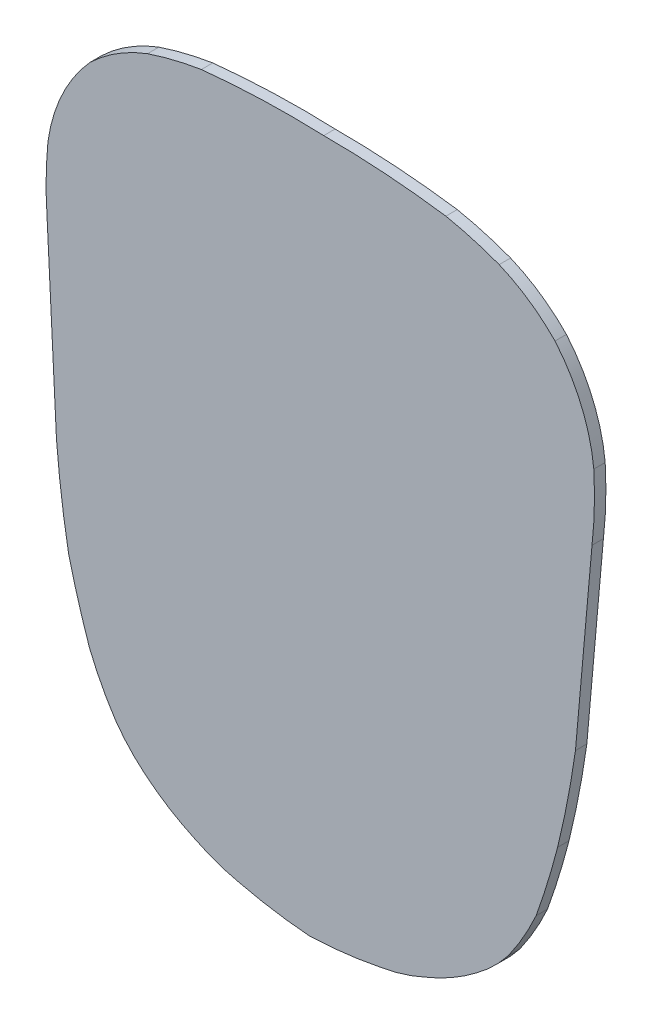
ISO-10303-21;
HEADER;
FILE_DESCRIPTION(('STEP AP214'),'2;1');
FILE_NAME('part.step','',(''),(''),'','','');
FILE_SCHEMA(('AUTOMOTIVE_DESIGN { 1 0 10303 214 1 1 1 1 }'));
ENDSEC;
DATA;
#1=APPLICATION_CONTEXT('core data for automotive mechanical design processes');
#2=APPLICATION_PROTOCOL_DEFINITION('international standard','automotive_design',2000,#1);
#3=PRODUCT_CONTEXT('',#1,'mechanical');
#4=PRODUCT('Part','Part','',(#3));
#5=PRODUCT_RELATED_PRODUCT_CATEGORY('part','',(#4));
#6=PRODUCT_DEFINITION_FORMATION('','',#4);
#7=PRODUCT_DEFINITION_CONTEXT('part definition',#1,'design');
#8=PRODUCT_DEFINITION('design','',#6,#7);
#9=PRODUCT_DEFINITION_SHAPE('','',#8);
#10=(LENGTH_UNIT() NAMED_UNIT(*) SI_UNIT(.MILLI.,.METRE.));
#11=(NAMED_UNIT(*) PLANE_ANGLE_UNIT() SI_UNIT($,.RADIAN.));
#12=(NAMED_UNIT(*) SI_UNIT($,.STERADIAN.) SOLID_ANGLE_UNIT());
#13=UNCERTAINTY_MEASURE_WITH_UNIT(LENGTH_MEASURE(1.E-05),#10,'distance_accuracy_value','');
#14=(GEOMETRIC_REPRESENTATION_CONTEXT(3) GLOBAL_UNCERTAINTY_ASSIGNED_CONTEXT((#13)) GLOBAL_UNIT_ASSIGNED_CONTEXT((#10,
#11,#12)) REPRESENTATION_CONTEXT('',''));
#15=CARTESIAN_POINT('',(0.,0.,0.));
#16=DIRECTION('',(0.,0.,1.));
#17=DIRECTION('',(1.,0.,0.));
#18=AXIS2_PLACEMENT_3D('',#15,#16,#17);
#19=CARTESIAN_POINT('',(-2.87645068487016,-22.2307778413905,37.7490965279302));
#20=DIRECTION('',(0.,0.,1.));
#21=DIRECTION('',(0.0193548335692301,0.999812677663925,0.));
#22=AXIS2_PLACEMENT_3D('',#19,#20,#21);
#23=PLANE('',#22);
#24=CARTESIAN_POINT('',(3.40605421210544,8.02001484887181,37.74909652793));
#25=DIRECTION('',(0.,0.,-1.));
#26=DIRECTION('',(-0.0193548335692301,-0.999812677663925,0.));
#27=AXIS2_PLACEMENT_3D('',#24,#25,#26);
#28=CIRCLE('',#27,7.43643173112);
#29=CARTESIAN_POINT('',(8.74976189327244,13.1916011731871,37.74909652793));
#30=VERTEX_POINT('',#29);
#31=CARTESIAN_POINT('',(6.29473617833669,14.8724621043842,37.74909652793));
#32=VERTEX_POINT('',#31);
#33=EDGE_CURVE('E362',#30,#32,#28,.F.);
#34=ORIENTED_EDGE('',*,*,#33,.F.);
#35=CARTESIAN_POINT('',(3.11803650286193,8.43130453548566,37.7490965279299));
#36=DIRECTION('',(0.,0.,-1.));
#37=DIRECTION('',(-0.0193548335692301,-0.999812677663925,0.));
#38=AXIS2_PLACEMENT_3D('',#35,#36,#37);
#39=CIRCLE('',#38,7.3740595978);
#40=CARTESIAN_POINT('',(10.4553019723894,9.16702892789532,37.7490965279302));
#41=VERTEX_POINT('',#40);
#42=EDGE_CURVE('E208',#41,#30,#39,.F.);
#43=ORIENTED_EDGE('',*,*,#42,.F.);
#44=CARTESIAN_POINT('',(-6.32552371849095,8.14421174061835,37.7490965279296));
#45=DIRECTION('',(0.,0.,-1.));
#46=DIRECTION('',(-0.0193548335692301,-0.999812677663925,0.));
#47=AXIS2_PLACEMENT_3D('',#44,#45,#46);
#48=CIRCLE('',#47,16.81196793556);
#49=CARTESIAN_POINT('',(10.3766044314373,6.2255713027891,37.7490965279302));
#50=VERTEX_POINT('',#49);
#51=EDGE_CURVE('E35',#50,#41,#48,.F.);
#52=ORIENTED_EDGE('',*,*,#51,.F.);
#53=DIRECTION('',(-0.0886995040357044,-0.996058431008854,0.));
#54=VECTOR('',#53,1.);
#55=CARTESIAN_POINT('',(10.3766044314373,6.22557130278913,37.7490965279302));
#56=LINE('',#55,#54);
#57=CARTESIAN_POINT('',(9.64811099468481,-1.95510611475094,37.7490965279302));
#58=VERTEX_POINT('',#57);
#59=EDGE_CURVE('E207',#50,#58,#56,.T.);
#60=ORIENTED_EDGE('',*,*,#59,.T.);
#61=CARTESIAN_POINT('',(-31.2814474166911,3.80134354731966,37.7490965279289));
#62=DIRECTION('',(0.,0.,-1.));
#63=DIRECTION('',(-0.0193548335692301,-0.999812677663925,0.));
#64=AXIS2_PLACEMENT_3D('',#61,#62,#63);
#65=CIRCLE('',#64,41.33237791928);
#66=CARTESIAN_POINT('',(8.86403234955447,-6.03257321052169,37.7490965279303));
#67=VERTEX_POINT('',#66);
#68=EDGE_CURVE('E218',#67,#58,#65,.F.);
#69=ORIENTED_EDGE('',*,*,#68,.F.);
#70=CARTESIAN_POINT('',(-24.973760623793,2.68335405814088,37.7490965279291));
#71=DIRECTION('',(0.,0.,-1.));
#72=DIRECTION('',(-0.0193548335692301,-0.999812677663925,0.));
#73=AXIS2_PLACEMENT_3D('',#70,#71,#72);
#74=CIRCLE('',#73,34.94228987144);
#75=CARTESIAN_POINT('',(7.91947678147986,-9.10641075970419,37.7490965279303));
#76=VERTEX_POINT('',#75);
#77=EDGE_CURVE('E302',#76,#67,#74,.F.);
#78=ORIENTED_EDGE('',*,*,#77,.F.);
#79=CARTESIAN_POINT('',(-3.58067037627299,-3.93497982202906,37.7490965279299));
#80=DIRECTION('',(0.,0.,-1.));
#81=DIRECTION('',(-0.0193548335692301,-0.999812677663925,0.));
#82=AXIS2_PLACEMENT_3D('',#79,#80,#81);
#83=CIRCLE('',#82,12.60940452968);
#84=CARTESIAN_POINT('',(6.6977668305515,-11.2391437836663,37.7490965279303));
#85=VERTEX_POINT('',#84);
#86=EDGE_CURVE('E305',#85,#76,#83,.F.);
#87=ORIENTED_EDGE('',*,*,#86,.F.);
#88=CARTESIAN_POINT('',(1.10266886694143,-6.8693447401081,37.74909652793));
#89=DIRECTION('',(0.,0.,-1.));
#90=DIRECTION('',(-0.0193548335692301,-0.999812677663925,0.));
#91=AXIS2_PLACEMENT_3D('',#88,#89,#90);
#92=CIRCLE('',#91,7.09931439672);
#93=CARTESIAN_POINT('',(5.30083998115867,-12.5943446701717,37.7490965279303));
#94=VERTEX_POINT('',#93);
#95=EDGE_CURVE('E308',#94,#85,#92,.F.);
#96=ORIENTED_EDGE('',*,*,#95,.F.);
#97=CARTESIAN_POINT('',(-0.638723059391806,-4.8395373063229,37.74909652793));
#98=DIRECTION('',(0.,0.,-1.));
#99=DIRECTION('',(-0.0193548335692301,-0.999812677663925,0.));
#100=AXIS2_PLACEMENT_3D('',#97,#98,#99);
#101=CIRCLE('',#100,9.76808304444);
#102=CARTESIAN_POINT('',(3.02325465351682,-13.8952187049387,37.7490965279302));
#103=VERTEX_POINT('',#102);
#104=EDGE_CURVE('E311',#103,#94,#101,.F.);
#105=ORIENTED_EDGE('',*,*,#104,.F.);
#106=CARTESIAN_POINT('',(-0.207770559998101,-6.83732878190939,37.74909652793));
#107=DIRECTION('',(0.,0.,-1.));
#108=DIRECTION('',(-0.0193548335692301,-0.999812677663925,0.));
#109=AXIS2_PLACEMENT_3D('',#106,#107,#108);
#110=CIRCLE('',#109,7.76230211316);
#111=CARTESIAN_POINT('',(1.1176538211111,-14.4856347581325,37.7490965279302));
#112=VERTEX_POINT('',#111);
#113=EDGE_CURVE('E314',#112,#103,#110,.F.);
#114=ORIENTED_EDGE('',*,*,#113,.F.);
#115=CARTESIAN_POINT('',(-2.80966912930586,4.75500909683406,37.7490965279298));
#116=DIRECTION('',(0.,0.,-1.));
#117=DIRECTION('',(-0.0193548335692301,-0.999812677663925,0.));
#118=AXIS2_PLACEMENT_3D('',#115,#116,#117);
#119=CIRCLE('',#118,19.6373684976);
#120=CARTESIAN_POINT('',(-2.01526832310904,-14.8662846645275,37.7490965279301));
#121=VERTEX_POINT('',#120);
#122=EDGE_CURVE('E317',#121,#112,#119,.F.);
#123=ORIENTED_EDGE('',*,*,#122,.F.);
#124=CARTESIAN_POINT('',(-0.523207579480535,4.71400533480674,37.7490965279299));
#125=DIRECTION('',(0.,0.,-1.));
#126=DIRECTION('',(-0.0193548335692301,-0.999812677663925,0.));
#127=AXIS2_PLACEMENT_3D('',#124,#125,#126);
#128=CIRCLE('',#127,19.63705684976);
#129=CARTESIAN_POINT('',(-5.17633782189552,-14.3637927736708,37.74909652793));
#130=VERTEX_POINT('',#129);
#131=EDGE_CURVE('E320',#130,#121,#128,.F.);
#132=ORIENTED_EDGE('',*,*,#131,.F.);
#133=CARTESIAN_POINT('',(-3.55589855490548,-6.77251418057695,37.7490965279299));
#134=DIRECTION('',(0.,0.,-1.));
#135=DIRECTION('',(-0.0193548335692301,-0.999812677663925,0.));
#136=AXIS2_PLACEMENT_3D('',#133,#134,#135);
#137=CIRCLE('',#136,7.76230211316);
#138=CARTESIAN_POINT('',(-7.05766041396077,-13.7000677154429,37.7490965279299));
#139=VERTEX_POINT('',#138);
#140=EDGE_CURVE('E323',#139,#130,#137,.F.);
#141=ORIENTED_EDGE('',*,*,#140,.F.);
#142=CARTESIAN_POINT('',(-3.04794957670766,-4.7928983915392,37.7490965279299));
#143=DIRECTION('',(0.,0.,-1.));
#144=DIRECTION('',(-0.0193548335692301,-0.999812677663925,0.));
#145=AXIS2_PLACEMENT_3D('',#142,#143,#144);
#146=CIRCLE('',#145,9.76808304444);
#147=CARTESIAN_POINT('',(-9.28319236302824,-12.3120202657153,37.7490965279298));
#148=VERTEX_POINT('',#147);
#149=EDGE_CURVE('E326',#148,#139,#146,.F.);
#150=ORIENTED_EDGE('',*,*,#149,.F.);
#151=CARTESIAN_POINT('',(-4.76167465689586,-6.83879977530864,37.7490965279299));
#152=DIRECTION('',(0.,0.,-1.));
#153=DIRECTION('',(-0.0193548335692301,-0.999812677663925,0.));
#154=AXIS2_PLACEMENT_3D('',#151,#152,#153);
#155=CIRCLE('',#154,7.09931439672);
#156=CARTESIAN_POINT('',(-10.5813963887554,-10.9046457963968,37.7490965279298));
#157=VERTEX_POINT('',#156);
#158=EDGE_CURVE('E329',#157,#148,#155,.F.);
#159=ORIENTED_EDGE('',*,*,#158,.F.);
#160=CARTESIAN_POINT('',(-0.0279711922388365,-4.00375460651088,37.74909652793));
#161=DIRECTION('',(0.,0.,-1.));
#162=DIRECTION('',(-0.0193548335692301,-0.999812677663925,0.));
#163=AXIS2_PLACEMENT_3D('',#160,#161,#162);
#164=CIRCLE('',#163,12.60940452968);
#165=CARTESIAN_POINT('',(-11.7196490905639,-8.72622753019508,37.7490965279297));
#166=VERTEX_POINT('',#165);
#167=EDGE_CURVE('E332',#166,#157,#164,.F.);
#168=ORIENTED_EDGE('',*,*,#167,.F.);
#169=CARTESIAN_POINT('',(21.3074102324667,2.68328490166428,37.7490965279306));
#170=DIRECTION('',(0.,0.,-1.));
#171=DIRECTION('',(-0.0193548335692301,-0.999812677663925,0.));
#172=AXIS2_PLACEMENT_3D('',#169,#170,#171);
#173=CIRCLE('',#172,34.94228987144);
#174=CARTESIAN_POINT('',(-12.6348799299236,-5.61638738053116,37.7490965279296));
#175=VERTEX_POINT('',#174);
#176=EDGE_CURVE('E335',#175,#166,#173,.F.);
#177=ORIENTED_EDGE('',*,*,#176,.F.);
#178=CARTESIAN_POINT('',(28.0310735031444,1.77588533100571,37.7490965279308));
#179=DIRECTION('',(0.,0.,-1.));
#180=DIRECTION('',(-0.0193548335692301,-0.999812677663925,0.));
#181=AXIS2_PLACEMENT_3D('',#178,#179,#180);
#182=CIRCLE('',#181,41.33237791928);
#183=CARTESIAN_POINT('',(-13.1702154109103,-1.51337845938621,37.7490965279296));
#184=VERTEX_POINT('',#183);
#185=EDGE_CURVE('E338',#184,#175,#182,.F.);
#186=ORIENTED_EDGE('',*,*,#185,.F.);
#187=DIRECTION('',(-0.0500831809567765,0.998745050042928,0.));
#188=VECTOR('',#187,1.);
#189=CARTESIAN_POINT('',(-13.1702154109103,-1.51337845938582,37.7490965279296));
#190=LINE('',#189,#188);
#191=CARTESIAN_POINT('',(-13.5815510662259,6.68936429385876,37.7490965279294));
#192=VERTEX_POINT('',#191);
#193=EDGE_CURVE('E226',#184,#192,#190,.T.);
#194=ORIENTED_EDGE('',*,*,#193,.T.);
#195=CARTESIAN_POINT('',(3.18231954948581,7.96015453853926,37.74909652793));
#196=DIRECTION('',(0.,0.,-1.));
#197=DIRECTION('',(-0.0193548335692301,-0.999812677663925,0.));
#198=AXIS2_PLACEMENT_3D('',#195,#196,#197);
#199=CIRCLE('',#198,16.81196793556);
#200=CARTESIAN_POINT('',(-13.5463481289565,9.63166390750369,37.7490965279294));
#201=VERTEX_POINT('',#200);
#202=EDGE_CURVE('E229',#201,#192,#199,.F.);
#203=ORIENTED_EDGE('',*,*,#202,.F.);
#204=CARTESIAN_POINT('',(-6.24305419079941,8.61252083374827,37.7490965279296));
#205=DIRECTION('',(0.,0.,-1.));
#206=DIRECTION('',(-0.0193548335692301,-0.999812677663925,0.));
#207=AXIS2_PLACEMENT_3D('',#204,#205,#206);
#208=CIRCLE('',#207,7.3740595978);
#209=CARTESIAN_POINT('',(-11.6863252040826,13.5872123445715,37.7490965279294));
#210=VERTEX_POINT('',#209);
#211=EDGE_CURVE('E344',#210,#201,#208,.F.);
#212=ORIENTED_EDGE('',*,*,#211,.F.);
#213=CARTESIAN_POINT('',(-6.54677401618388,8.21268627443502,37.7490965279296));
#214=DIRECTION('',(0.,0.,-1.));
#215=DIRECTION('',(-0.0193548335692301,-0.999812677663925,0.));
#216=AXIS2_PLACEMENT_3D('',#213,#214,#215);
#217=CIRCLE('',#216,7.43643173112);
#218=CARTESIAN_POINT('',(-9.16808546254458,15.17179851615,37.7490965279295));
#219=VERTEX_POINT('',#218);
#220=EDGE_CURVE('E347',#219,#210,#217,.F.);
#221=ORIENTED_EDGE('',*,*,#220,.F.);
#222=CARTESIAN_POINT('',(-4.43670572158507,1.02428534892829,37.7490965279298));
#223=DIRECTION('',(0.,0.,-1.));
#224=DIRECTION('',(-0.0193548335692301,-0.999812677663925,0.));
#225=AXIS2_PLACEMENT_3D('',#222,#223,#224);
#226=CIRCLE('',#225,14.91771038296);
#227=CARTESIAN_POINT('',(-6.80003650135269,15.7536013783736,37.7490965279295));
#228=VERTEX_POINT('',#227);
#229=EDGE_CURVE('E350',#228,#219,#226,.F.);
#230=ORIENTED_EDGE('',*,*,#229,.F.);
#231=CARTESIAN_POINT('',(-2.87645068487016,-22.2307778413905,37.7490965279302));
#232=DIRECTION('',(0.,0.,-1.));
#233=DIRECTION('',(-0.0193548335692301,-0.999812677663925,0.));
#234=AXIS2_PLACEMENT_3D('',#231,#232,#233);
#235=CIRCLE('',#234,38.18648439396);
#236=CARTESIAN_POINT('',(-1.41914055333809,15.9278887698878,37.7490965279297));
#237=VERTEX_POINT('',#236);
#238=EDGE_CURVE('E353',#237,#228,#235,.F.);
#239=ORIENTED_EDGE('',*,*,#238,.F.);
#240=CARTESIAN_POINT('',(-1.43975485684205,-22.2585901013477,37.7490965279302));
#241=DIRECTION('',(0.,0.,-1.));
#242=DIRECTION('',(-0.0193548335692301,-0.999812677663925,0.));
#243=AXIS2_PLACEMENT_3D('',#240,#241,#242);
#244=CIRCLE('',#243,38.186484435371);
#245=CARTESIAN_POINT('',(3.95097858118662,15.5454782846467,37.7490965279299));
#246=VERTEX_POINT('',#245);
#247=EDGE_CURVE('E356',#246,#237,#244,.F.);
#248=ORIENTED_EDGE('',*,*,#247,.F.);
#249=CARTESIAN_POINT('',(1.01935833845516,0.918664351931265,37.74909652793));
#250=DIRECTION('',(0.,0.,-1.));
#251=DIRECTION('',(-0.0193548335692301,-0.999812677663925,0.));
#252=AXIS2_PLACEMENT_3D('',#249,#250,#251);
#253=CIRCLE('',#252,14.91771038296);
#254=EDGE_CURVE('E359',#32,#246,#253,.F.);
#255=ORIENTED_EDGE('',*,*,#254,.F.);
#256=EDGE_LOOP('',(#34,#43,#52,#60,#69,#78,#87,#96,#105,#114,#123,#132,#141,#150,#159,#168,#177,
#186,#194,#203,#212,#221,#230,#239,#248,#255));
#257=FACE_BOUND('',#256,.T.);
#258=ADVANCED_FACE('F32',(#257),#23,.F.);
#259=CARTESIAN_POINT('',(-6.32552371849096,8.14421174061835,38.1300965279296));
#260=DIRECTION('',(0.,0.,-1.));
#261=DIRECTION('',(-0.0193548335692301,-0.999812677663925,0.));
#262=AXIS2_PLACEMENT_3D('',#259,#260,#261);
#263=CYLINDRICAL_SURFACE('',#262,16.81196793556);
#264=DIRECTION('',(0.,0.,-1.));
#265=VECTOR('',#264,1.);
#266=CARTESIAN_POINT('',(10.4553019723893,9.16702892789537,38.1300965279302));
#267=LINE('',#266,#265);
#268=CARTESIAN_POINT('',(10.4553019723893,9.16702892789536,38.2500965279301));
#269=VERTEX_POINT('',#268);
#270=EDGE_CURVE('E211',#269,#41,#267,.T.);
#271=ORIENTED_EDGE('',*,*,#270,.F.);
#272=CARTESIAN_POINT('',(-6.32552371849096,8.14421174061835,38.2500965279296));
#273=DIRECTION('',(0.,0.,-1.));
#274=DIRECTION('',(-0.0193548335692301,-0.999812677663925,0.));
#275=AXIS2_PLACEMENT_3D('',#272,#273,#274);
#276=CIRCLE('',#275,16.81196793556);
#277=CARTESIAN_POINT('',(10.3766044314372,6.22557130278923,38.2500965279302));
#278=VERTEX_POINT('',#277);
#279=EDGE_CURVE('E216',#278,#269,#276,.F.);
#280=ORIENTED_EDGE('',*,*,#279,.F.);
#281=DIRECTION('',(0.,0.,1.));
#282=VECTOR('',#281,1.);
#283=CARTESIAN_POINT('',(10.3766044314372,6.22557130278915,38.1300965279302));
#284=LINE('',#283,#282);
#285=EDGE_CURVE('E213',#278,#50,#284,.F.);
#286=ORIENTED_EDGE('',*,*,#285,.T.);
#287=ORIENTED_EDGE('',*,*,#51,.T.);
#288=EDGE_LOOP('',(#271,#280,#286,#287));
#289=FACE_BOUND('',#288,.T.);
#290=ADVANCED_FACE('F214',(#289),#263,.T.);
#291=CARTESIAN_POINT('',(3.11803650286192,8.43130453548566,38.1300965279299));
#292=DIRECTION('',(0.,0.,-1.));
#293=DIRECTION('',(-0.0193548335692301,-0.999812677663925,0.));
#294=AXIS2_PLACEMENT_3D('',#291,#292,#293);
#295=CYLINDRICAL_SURFACE('',#294,7.3740595978);
#296=DIRECTION('',(0.,0.,-1.));
#297=VECTOR('',#296,1.);
#298=CARTESIAN_POINT('',(8.74976189327242,13.1916011731871,38.13009652793));
#299=LINE('',#298,#297);
#300=CARTESIAN_POINT('',(8.74976189327242,13.1916011731871,38.25009652793));
#301=VERTEX_POINT('',#300);
#302=EDGE_CURVE('E363',#301,#30,#299,.T.);
#303=ORIENTED_EDGE('',*,*,#302,.F.);
#304=CARTESIAN_POINT('',(3.11803650286191,8.43130453548566,38.2500965279299));
#305=DIRECTION('',(0.,0.,-1.));
#306=DIRECTION('',(-0.0193548335692301,-0.999812677663925,0.));
#307=AXIS2_PLACEMENT_3D('',#304,#305,#306);
#308=CIRCLE('',#307,7.3740595978);
#309=EDGE_CURVE('E296',#269,#301,#308,.F.);
#310=ORIENTED_EDGE('',*,*,#309,.F.);
#311=ORIENTED_EDGE('',*,*,#270,.T.);
#312=ORIENTED_EDGE('',*,*,#42,.T.);
#313=EDGE_LOOP('',(#303,#310,#311,#312));
#314=FACE_BOUND('',#313,.T.);
#315=ADVANCED_FACE('F367',(#314),#295,.T.);
#316=CARTESIAN_POINT('',(3.40605421210543,8.02001484887182,38.13009652793));
#317=DIRECTION('',(0.,0.,-1.));
#318=DIRECTION('',(-0.0193548335692301,-0.999812677663925,0.));
#319=AXIS2_PLACEMENT_3D('',#316,#317,#318);
#320=CYLINDRICAL_SURFACE('',#319,7.43643173112);
#321=DIRECTION('',(0.,0.,-1.));
#322=VECTOR('',#321,1.);
#323=CARTESIAN_POINT('',(6.29473617833669,14.8724621043842,38.13009652793));
#324=LINE('',#323,#322);
#325=CARTESIAN_POINT('',(6.29473617833668,14.8724621043842,38.2500965279299));
#326=VERTEX_POINT('',#325);
#327=EDGE_CURVE('E361',#326,#32,#324,.T.);
#328=ORIENTED_EDGE('',*,*,#327,.F.);
#329=CARTESIAN_POINT('',(3.40605421210542,8.02001484887182,38.2500965279299));
#330=DIRECTION('',(0.,0.,-1.));
#331=DIRECTION('',(-0.0193548335692301,-0.999812677663925,0.));
#332=AXIS2_PLACEMENT_3D('',#329,#330,#331);
#333=CIRCLE('',#332,7.43643173112);
#334=EDGE_CURVE('E293',#301,#326,#333,.F.);
#335=ORIENTED_EDGE('',*,*,#334,.F.);
#336=ORIENTED_EDGE('',*,*,#302,.T.);
#337=ORIENTED_EDGE('',*,*,#33,.T.);
#338=EDGE_LOOP('',(#328,#335,#336,#337));
#339=FACE_BOUND('',#338,.T.);
#340=ADVANCED_FACE('F423',(#339),#320,.T.);
#341=CARTESIAN_POINT('',(1.01935833845515,0.918664351931272,38.13009652793));
#342=DIRECTION('',(0.,0.,-1.));
#343=DIRECTION('',(-0.0193548335692301,-0.999812677663925,0.));
#344=AXIS2_PLACEMENT_3D('',#341,#342,#343);
#345=CYLINDRICAL_SURFACE('',#344,14.91771038296);
#346=DIRECTION('',(0.,0.,-1.));
#347=VECTOR('',#346,1.);
#348=CARTESIAN_POINT('',(3.95097858118664,15.5454782846467,38.1300965279299));
#349=LINE('',#348,#347);
#350=CARTESIAN_POINT('',(3.95097858118661,15.5454782846467,38.2500965279298));
#351=VERTEX_POINT('',#350);
#352=EDGE_CURVE('E358',#351,#246,#349,.T.);
#353=ORIENTED_EDGE('',*,*,#352,.F.);
#354=CARTESIAN_POINT('',(1.01935833845515,0.918664351931274,38.2500965279299));
#355=DIRECTION('',(0.,0.,-1.));
#356=DIRECTION('',(-0.0193548335692301,-0.999812677663925,0.));
#357=AXIS2_PLACEMENT_3D('',#354,#355,#356);
#358=CIRCLE('',#357,14.91771038296);
#359=EDGE_CURVE('E290',#326,#351,#358,.F.);
#360=ORIENTED_EDGE('',*,*,#359,.F.);
#361=ORIENTED_EDGE('',*,*,#327,.T.);
#362=ORIENTED_EDGE('',*,*,#254,.T.);
#363=EDGE_LOOP('',(#353,#360,#361,#362));
#364=FACE_BOUND('',#363,.T.);
#365=ADVANCED_FACE('F419',(#364),#345,.T.);
#366=CARTESIAN_POINT('',(-1.43975485684206,-22.2585901013477,38.1300965279302));
#367=DIRECTION('',(0.,0.,-1.));
#368=DIRECTION('',(-0.0193548335692301,-0.999812677663925,0.));
#369=AXIS2_PLACEMENT_3D('',#366,#367,#368);
#370=CYLINDRICAL_SURFACE('',#369,38.186484435371);
#371=DIRECTION('',(0.,0.,-1.));
#372=VECTOR('',#371,1.);
#373=CARTESIAN_POINT('',(-1.41914055333799,15.9278887698878,38.1300965279297));
#374=LINE('',#373,#372);
#375=CARTESIAN_POINT('',(-1.4191405533381,15.9278887698878,38.2500965279296));
#376=VERTEX_POINT('',#375);
#377=EDGE_CURVE('E355',#376,#237,#374,.T.);
#378=ORIENTED_EDGE('',*,*,#377,.F.);
#379=CARTESIAN_POINT('',(-1.43975485684206,-22.2585901013477,38.2500965279302));
#380=DIRECTION('',(0.,0.,-1.));
#381=DIRECTION('',(-0.0193548335692301,-0.999812677663925,0.));
#382=AXIS2_PLACEMENT_3D('',#379,#380,#381);
#383=CIRCLE('',#382,38.186484435371);
#384=EDGE_CURVE('E287',#351,#376,#383,.F.);
#385=ORIENTED_EDGE('',*,*,#384,.F.);
#386=ORIENTED_EDGE('',*,*,#352,.T.);
#387=ORIENTED_EDGE('',*,*,#247,.T.);
#388=EDGE_LOOP('',(#378,#385,#386,#387));
#389=FACE_BOUND('',#388,.T.);
#390=ADVANCED_FACE('F428',(#389),#370,.T.);
#391=CARTESIAN_POINT('',(-2.87645068487017,-22.2307778413905,38.1300965279302));
#392=DIRECTION('',(0.,0.,-1.));
#393=DIRECTION('',(-0.0193548335692301,-0.999812677663925,0.));
#394=AXIS2_PLACEMENT_3D('',#391,#392,#393);
#395=CYLINDRICAL_SURFACE('',#394,38.18648439396);
#396=DIRECTION('',(0.,0.,-1.));
#397=VECTOR('',#396,1.);
#398=CARTESIAN_POINT('',(-6.80003650135271,15.7536013783736,38.1300965279295));
#399=LINE('',#398,#397);
#400=CARTESIAN_POINT('',(-6.80003650135273,15.7536013783736,38.2500965279295));
#401=VERTEX_POINT('',#400);
#402=EDGE_CURVE('E352',#401,#228,#399,.T.);
#403=ORIENTED_EDGE('',*,*,#402,.F.);
#404=CARTESIAN_POINT('',(-2.87645068487018,-22.2307778413905,38.2500965279301));
#405=DIRECTION('',(0.,0.,-1.));
#406=DIRECTION('',(-0.0193548335692301,-0.999812677663925,0.));
#407=AXIS2_PLACEMENT_3D('',#404,#405,#406);
#408=CIRCLE('',#407,38.18648439396);
#409=EDGE_CURVE('E284',#376,#401,#408,.F.);
#410=ORIENTED_EDGE('',*,*,#409,.F.);
#411=ORIENTED_EDGE('',*,*,#377,.T.);
#412=ORIENTED_EDGE('',*,*,#238,.T.);
#413=EDGE_LOOP('',(#403,#410,#411,#412));
#414=FACE_BOUND('',#413,.T.);
#415=ADVANCED_FACE('F432',(#414),#395,.T.);
#416=CARTESIAN_POINT('',(-4.43670572158509,1.0242853489283,38.1300965279298));
#417=DIRECTION('',(0.,0.,-1.));
#418=DIRECTION('',(-0.0193548335692301,-0.999812677663925,0.));
#419=AXIS2_PLACEMENT_3D('',#416,#417,#418);
#420=CYLINDRICAL_SURFACE('',#419,14.91771038296);
#421=DIRECTION('',(0.,0.,-1.));
#422=VECTOR('',#421,1.);
#423=CARTESIAN_POINT('',(-9.16808546254456,15.17179851615,38.1300965279295));
#424=LINE('',#423,#422);
#425=CARTESIAN_POINT('',(-9.16808546254458,15.17179851615,38.2500965279295));
#426=VERTEX_POINT('',#425);
#427=EDGE_CURVE('E349',#426,#219,#424,.T.);
#428=ORIENTED_EDGE('',*,*,#427,.F.);
#429=CARTESIAN_POINT('',(-4.43670572158509,1.0242853489283,38.2500965279298));
#430=DIRECTION('',(0.,0.,-1.));
#431=DIRECTION('',(-0.0193548335692301,-0.999812677663925,0.));
#432=AXIS2_PLACEMENT_3D('',#429,#430,#431);
#433=CIRCLE('',#432,14.91771038296);
#434=EDGE_CURVE('E281',#401,#426,#433,.F.);
#435=ORIENTED_EDGE('',*,*,#434,.F.);
#436=ORIENTED_EDGE('',*,*,#402,.T.);
#437=ORIENTED_EDGE('',*,*,#229,.T.);
#438=EDGE_LOOP('',(#428,#435,#436,#437));
#439=FACE_BOUND('',#438,.T.);
#440=ADVANCED_FACE('F434',(#439),#420,.T.);
#441=CARTESIAN_POINT('',(-6.5467740161839,8.21268627443503,38.1300965279296));
#442=DIRECTION('',(0.,0.,-1.));
#443=DIRECTION('',(-0.0193548335692301,-0.999812677663925,0.));
#444=AXIS2_PLACEMENT_3D('',#441,#442,#443);
#445=CYLINDRICAL_SURFACE('',#444,7.43643173112);
#446=DIRECTION('',(0.,0.,-1.));
#447=VECTOR('',#446,1.);
#448=CARTESIAN_POINT('',(-11.6863252040826,13.5872123445715,38.1300965279294));
#449=LINE('',#448,#447);
#450=CARTESIAN_POINT('',(-11.6863252040826,13.5872123445715,38.2500965279294));
#451=VERTEX_POINT('',#450);
#452=EDGE_CURVE('E346',#451,#210,#449,.T.);
#453=ORIENTED_EDGE('',*,*,#452,.F.);
#454=CARTESIAN_POINT('',(-6.5467740161839,8.21268627443503,38.2500965279296));
#455=DIRECTION('',(0.,0.,-1.));
#456=DIRECTION('',(-0.0193548335692301,-0.999812677663925,0.));
#457=AXIS2_PLACEMENT_3D('',#454,#455,#456);
#458=CIRCLE('',#457,7.43643173112);
#459=EDGE_CURVE('E278',#426,#451,#458,.F.);
#460=ORIENTED_EDGE('',*,*,#459,.F.);
#461=ORIENTED_EDGE('',*,*,#427,.T.);
#462=ORIENTED_EDGE('',*,*,#220,.T.);
#463=EDGE_LOOP('',(#453,#460,#461,#462));
#464=FACE_BOUND('',#463,.T.);
#465=ADVANCED_FACE('F438',(#464),#445,.T.);
#466=CARTESIAN_POINT('',(-6.24305419079942,8.61252083374827,38.1300965279296));
#467=DIRECTION('',(0.,0.,-1.));
#468=DIRECTION('',(-0.0193548335692301,-0.999812677663925,0.));
#469=AXIS2_PLACEMENT_3D('',#466,#467,#468);
#470=CYLINDRICAL_SURFACE('',#469,7.3740595978);
#471=DIRECTION('',(0.,0.,-1.));
#472=VECTOR('',#471,1.);
#473=CARTESIAN_POINT('',(-13.5463481289565,9.6316639075037,38.1300965279294));
#474=LINE('',#473,#472);
#475=CARTESIAN_POINT('',(-13.5463481289566,9.63166390750369,38.2500965279294));
#476=VERTEX_POINT('',#475);
#477=EDGE_CURVE('E343',#476,#201,#474,.T.);
#478=ORIENTED_EDGE('',*,*,#477,.F.);
#479=CARTESIAN_POINT('',(-6.24305419079943,8.61252083374827,38.2500965279296));
#480=DIRECTION('',(0.,0.,-1.));
#481=DIRECTION('',(-0.0193548335692301,-0.999812677663925,0.));
#482=AXIS2_PLACEMENT_3D('',#479,#480,#481);
#483=CIRCLE('',#482,7.3740595978);
#484=EDGE_CURVE('E275',#451,#476,#483,.F.);
#485=ORIENTED_EDGE('',*,*,#484,.F.);
#486=ORIENTED_EDGE('',*,*,#452,.T.);
#487=ORIENTED_EDGE('',*,*,#211,.T.);
#488=EDGE_LOOP('',(#478,#485,#486,#487));
#489=FACE_BOUND('',#488,.T.);
#490=ADVANCED_FACE('F443',(#489),#470,.T.);
#491=CARTESIAN_POINT('',(3.1823195494858,7.96015453853927,38.13009652793));
#492=DIRECTION('',(0.,0.,-1.));
#493=DIRECTION('',(-0.0193548335692301,-0.999812677663925,0.));
#494=AXIS2_PLACEMENT_3D('',#491,#492,#493);
#495=CYLINDRICAL_SURFACE('',#494,16.81196793556);
#496=DIRECTION('',(0.,0.,1.));
#497=VECTOR('',#496,1.);
#498=CARTESIAN_POINT('',(-13.5815510662259,6.68936429385879,38.1300965279294));
#499=LINE('',#498,#497);
#500=CARTESIAN_POINT('',(-13.5815510662259,6.68936429385877,38.2500965279294));
#501=VERTEX_POINT('',#500);
#502=EDGE_CURVE('E228',#192,#501,#499,.T.);
#503=ORIENTED_EDGE('',*,*,#502,.T.);
#504=CARTESIAN_POINT('',(3.1823195494858,7.96015453853927,38.2500965279299));
#505=DIRECTION('',(0.,0.,-1.));
#506=DIRECTION('',(-0.0193548335692301,-0.999812677663925,0.));
#507=AXIS2_PLACEMENT_3D('',#504,#505,#506);
#508=CIRCLE('',#507,16.81196793556);
#509=EDGE_CURVE('E272',#476,#501,#508,.F.);
#510=ORIENTED_EDGE('',*,*,#509,.F.);
#511=ORIENTED_EDGE('',*,*,#477,.T.);
#512=ORIENTED_EDGE('',*,*,#202,.T.);
#513=EDGE_LOOP('',(#503,#510,#511,#512));
#514=FACE_BOUND('',#513,.T.);
#515=ADVANCED_FACE('F447',(#514),#495,.T.);
#516=CARTESIAN_POINT('',(-13.1702154109103,-1.51337845938581,38.1300965279296));
#517=DIRECTION('',(0.998745050042928,0.0500831809567765,0.));
#518=DIRECTION('',(-0.0500831809567765,0.998745050042928,0.));
#519=AXIS2_PLACEMENT_3D('',#516,#517,#518);
#520=PLANE('',#519);
#521=ORIENTED_EDGE('',*,*,#502,.F.);
#522=ORIENTED_EDGE('',*,*,#193,.F.);
#523=DIRECTION('',(0.,0.,-1.));
#524=VECTOR('',#523,1.);
#525=CARTESIAN_POINT('',(-13.1702154109103,-1.51337845938602,38.1300965279296));
#526=LINE('',#525,#524);
#527=CARTESIAN_POINT('',(-13.1702154109103,-1.51337845938607,38.2500965279295));
#528=VERTEX_POINT('',#527);
#529=EDGE_CURVE('E340',#528,#184,#526,.T.);
#530=ORIENTED_EDGE('',*,*,#529,.F.);
#531=DIRECTION('',(0.050083180956776,-0.998745050042928,0.));
#532=VECTOR('',#531,1.);
#533=CARTESIAN_POINT('',(-13.5815510662259,6.68936429385873,38.2500965279294));
#534=LINE('',#533,#532);
#535=EDGE_CURVE('E271',#501,#528,#534,.T.);
#536=ORIENTED_EDGE('',*,*,#535,.F.);
#537=EDGE_LOOP('',(#521,#522,#530,#536));
#538=FACE_BOUND('',#537,.T.);
#539=ADVANCED_FACE('F451',(#538),#520,.F.);
#540=CARTESIAN_POINT('',(28.0310735031444,1.77588533100572,38.1300965279308));
#541=DIRECTION('',(0.,0.,-1.));
#542=DIRECTION('',(-0.0193548335692301,-0.999812677663925,0.));
#543=AXIS2_PLACEMENT_3D('',#540,#541,#542);
#544=CYLINDRICAL_SURFACE('',#543,41.33237791928);
#545=DIRECTION('',(0.,0.,-1.));
#546=VECTOR('',#545,1.);
#547=CARTESIAN_POINT('',(-12.6348799299236,-5.61638738053124,38.1300965279296));
#548=LINE('',#547,#546);
#549=CARTESIAN_POINT('',(-12.6348799299236,-5.61638738053115,38.2500965279296));
#550=VERTEX_POINT('',#549);
#551=EDGE_CURVE('E337',#550,#175,#548,.T.);
#552=ORIENTED_EDGE('',*,*,#551,.F.);
#553=CARTESIAN_POINT('',(28.0310735031444,1.77588533100572,38.2500965279308));
#554=DIRECTION('',(0.,0.,-1.));
#555=DIRECTION('',(-0.0193548335692301,-0.999812677663925,0.));
#556=AXIS2_PLACEMENT_3D('',#553,#554,#555);
#557=CIRCLE('',#556,41.33237791928);
#558=EDGE_CURVE('E268',#528,#550,#557,.F.);
#559=ORIENTED_EDGE('',*,*,#558,.F.);
#560=ORIENTED_EDGE('',*,*,#529,.T.);
#561=ORIENTED_EDGE('',*,*,#185,.T.);
#562=EDGE_LOOP('',(#552,#559,#560,#561));
#563=FACE_BOUND('',#562,.T.);
#564=ADVANCED_FACE('F456',(#563),#544,.T.);
#565=CARTESIAN_POINT('',(21.3074102324666,2.68328490166428,38.1300965279306));
#566=DIRECTION('',(0.,0.,-1.));
#567=DIRECTION('',(-0.0193548335692301,-0.999812677663925,0.));
#568=AXIS2_PLACEMENT_3D('',#565,#566,#567);
#569=CYLINDRICAL_SURFACE('',#568,34.94228987144);
#570=DIRECTION('',(0.,0.,-1.));
#571=VECTOR('',#570,1.);
#572=CARTESIAN_POINT('',(-11.719649090564,-8.72622753019503,38.1300965279297));
#573=LINE('',#572,#571);
#574=CARTESIAN_POINT('',(-11.719649090564,-8.72622753019504,38.2500965279297));
#575=VERTEX_POINT('',#574);
#576=EDGE_CURVE('E334',#575,#166,#573,.T.);
#577=ORIENTED_EDGE('',*,*,#576,.F.);
#578=CARTESIAN_POINT('',(21.3074102324666,2.68328490166428,38.2500965279306));
#579=DIRECTION('',(0.,0.,-1.));
#580=DIRECTION('',(-0.0193548335692301,-0.999812677663925,0.));
#581=AXIS2_PLACEMENT_3D('',#578,#579,#580);
#582=CIRCLE('',#581,34.94228987144);
#583=EDGE_CURVE('E265',#550,#575,#582,.F.);
#584=ORIENTED_EDGE('',*,*,#583,.F.);
#585=ORIENTED_EDGE('',*,*,#551,.T.);
#586=ORIENTED_EDGE('',*,*,#176,.T.);
#587=EDGE_LOOP('',(#577,#584,#585,#586));
#588=FACE_BOUND('',#587,.T.);
#589=ADVANCED_FACE('F460',(#588),#569,.T.);
#590=CARTESIAN_POINT('',(-0.0279711922388487,-4.00375460651087,38.13009652793));
#591=DIRECTION('',(0.,0.,-1.));
#592=DIRECTION('',(-0.0193548335692301,-0.999812677663925,0.));
#593=AXIS2_PLACEMENT_3D('',#590,#591,#592);
#594=CYLINDRICAL_SURFACE('',#593,12.60940452968);
#595=DIRECTION('',(0.,0.,-1.));
#596=VECTOR('',#595,1.);
#597=CARTESIAN_POINT('',(-10.5813963887554,-10.9046457963967,38.1300965279298));
#598=LINE('',#597,#596);
#599=CARTESIAN_POINT('',(-10.5813963887554,-10.9046457963968,38.2500965279297));
#600=VERTEX_POINT('',#599);
#601=EDGE_CURVE('E331',#600,#157,#598,.T.);
#602=ORIENTED_EDGE('',*,*,#601,.F.);
#603=CARTESIAN_POINT('',(-0.0279711922388526,-4.00375460651087,38.25009652793));
#604=DIRECTION('',(0.,0.,-1.));
#605=DIRECTION('',(-0.0193548335692301,-0.999812677663925,0.));
#606=AXIS2_PLACEMENT_3D('',#603,#604,#605);
#607=CIRCLE('',#606,12.60940452968);
#608=EDGE_CURVE('E262',#575,#600,#607,.F.);
#609=ORIENTED_EDGE('',*,*,#608,.F.);
#610=ORIENTED_EDGE('',*,*,#576,.T.);
#611=ORIENTED_EDGE('',*,*,#167,.T.);
#612=EDGE_LOOP('',(#602,#609,#610,#611));
#613=FACE_BOUND('',#612,.T.);
#614=ADVANCED_FACE('F464',(#613),#594,.T.);
#615=CARTESIAN_POINT('',(-4.76167465689587,-6.83879977530864,38.1300965279299));
#616=DIRECTION('',(0.,0.,-1.));
#617=DIRECTION('',(-0.0193548335692301,-0.999812677663925,0.));
#618=AXIS2_PLACEMENT_3D('',#615,#616,#617);
#619=CYLINDRICAL_SURFACE('',#618,7.09931439672);
#620=DIRECTION('',(0.,0.,-1.));
#621=VECTOR('',#620,1.);
#622=CARTESIAN_POINT('',(-9.28319236302893,-12.3120202657147,38.1300965279298));
#623=LINE('',#622,#621);
#624=CARTESIAN_POINT('',(-9.2831923630282,-12.3120202657153,38.2500965279298));
#625=VERTEX_POINT('',#624);
#626=EDGE_CURVE('E328',#625,#148,#623,.T.);
#627=ORIENTED_EDGE('',*,*,#626,.F.);
#628=CARTESIAN_POINT('',(-4.76167465689588,-6.83879977530864,38.2500965279299));
#629=DIRECTION('',(0.,0.,-1.));
#630=DIRECTION('',(-0.0193548335692301,-0.999812677663925,0.));
#631=AXIS2_PLACEMENT_3D('',#628,#629,#630);
#632=CIRCLE('',#631,7.09931439672);
#633=EDGE_CURVE('E259',#600,#625,#632,.F.);
#634=ORIENTED_EDGE('',*,*,#633,.F.);
#635=ORIENTED_EDGE('',*,*,#601,.T.);
#636=ORIENTED_EDGE('',*,*,#158,.T.);
#637=EDGE_LOOP('',(#627,#634,#635,#636));
#638=FACE_BOUND('',#637,.T.);
#639=ADVANCED_FACE('F468',(#638),#619,.T.);
#640=CARTESIAN_POINT('',(-3.04794957670768,-4.79289839153919,38.1300965279299));
#641=DIRECTION('',(0.,0.,-1.));
#642=DIRECTION('',(-0.0193548335692301,-0.999812677663925,0.));
#643=AXIS2_PLACEMENT_3D('',#640,#641,#642);
#644=CYLINDRICAL_SURFACE('',#643,9.76808304444);
#645=DIRECTION('',(0.,0.,-1.));
#646=VECTOR('',#645,1.);
#647=CARTESIAN_POINT('',(-7.05766041396078,-13.7000677154429,38.1300965279299));
#648=LINE('',#647,#646);
#649=CARTESIAN_POINT('',(-7.05766041396078,-13.7000677154429,38.2500965279299));
#650=VERTEX_POINT('',#649);
#651=EDGE_CURVE('E325',#650,#139,#648,.T.);
#652=ORIENTED_EDGE('',*,*,#651,.F.);
#653=CARTESIAN_POINT('',(-3.04794957670768,-4.79289839153919,38.2500965279299));
#654=DIRECTION('',(0.,0.,-1.));
#655=DIRECTION('',(-0.0193548335692301,-0.999812677663925,0.));
#656=AXIS2_PLACEMENT_3D('',#653,#654,#655);
#657=CIRCLE('',#656,9.76808304444);
#658=EDGE_CURVE('E256',#625,#650,#657,.F.);
#659=ORIENTED_EDGE('',*,*,#658,.F.);
#660=ORIENTED_EDGE('',*,*,#626,.T.);
#661=ORIENTED_EDGE('',*,*,#149,.T.);
#662=EDGE_LOOP('',(#652,#659,#660,#661));
#663=FACE_BOUND('',#662,.T.);
#664=ADVANCED_FACE('F472',(#663),#644,.T.);
#665=CARTESIAN_POINT('',(-3.55589855490549,-6.77251418057694,38.1300965279299));
#666=DIRECTION('',(0.,0.,-1.));
#667=DIRECTION('',(-0.0193548335692301,-0.999812677663925,0.));
#668=AXIS2_PLACEMENT_3D('',#665,#666,#667);
#669=CYLINDRICAL_SURFACE('',#668,7.76230211316);
#670=DIRECTION('',(0.,0.,-1.));
#671=VECTOR('',#670,1.);
#672=CARTESIAN_POINT('',(-5.1763378218955,-14.3637927736708,38.13009652793));
#673=LINE('',#672,#671);
#674=CARTESIAN_POINT('',(-5.17633782189547,-14.3637927736708,38.25009652793));
#675=VERTEX_POINT('',#674);
#676=EDGE_CURVE('E322',#675,#130,#673,.T.);
#677=ORIENTED_EDGE('',*,*,#676,.F.);
#678=CARTESIAN_POINT('',(-3.5558985549055,-6.77251418057694,38.2500965279299));
#679=DIRECTION('',(0.,0.,-1.));
#680=DIRECTION('',(-0.0193548335692301,-0.999812677663925,0.));
#681=AXIS2_PLACEMENT_3D('',#678,#679,#680);
#682=CIRCLE('',#681,7.76230211316);
#683=EDGE_CURVE('E253',#650,#675,#682,.F.);
#684=ORIENTED_EDGE('',*,*,#683,.F.);
#685=ORIENTED_EDGE('',*,*,#651,.T.);
#686=ORIENTED_EDGE('',*,*,#140,.T.);
#687=EDGE_LOOP('',(#677,#684,#685,#686));
#688=FACE_BOUND('',#687,.T.);
#689=ADVANCED_FACE('F476',(#688),#669,.T.);
#690=CARTESIAN_POINT('',(-0.523207579480548,4.71400533480674,38.1300965279299));
#691=DIRECTION('',(0.,0.,-1.));
#692=DIRECTION('',(-0.0193548335692301,-0.999812677663925,0.));
#693=AXIS2_PLACEMENT_3D('',#690,#691,#692);
#694=CYLINDRICAL_SURFACE('',#693,19.63705684976);
#695=DIRECTION('',(0.,0.,-1.));
#696=VECTOR('',#695,1.);
#697=CARTESIAN_POINT('',(-2.01526832310905,-14.8662846645275,38.1300965279301));
#698=LINE('',#697,#696);
#699=CARTESIAN_POINT('',(-2.01526832310905,-14.8662846645275,38.2500965279301));
#700=VERTEX_POINT('',#699);
#701=EDGE_CURVE('E319',#700,#121,#698,.T.);
#702=ORIENTED_EDGE('',*,*,#701,.F.);
#703=CARTESIAN_POINT('',(-0.523207579480551,4.71400533480675,38.2500965279298));
#704=DIRECTION('',(0.,0.,-1.));
#705=DIRECTION('',(-0.0193548335692301,-0.999812677663925,0.));
#706=AXIS2_PLACEMENT_3D('',#703,#704,#705);
#707=CIRCLE('',#706,19.63705684976);
#708=EDGE_CURVE('E250',#675,#700,#707,.F.);
#709=ORIENTED_EDGE('',*,*,#708,.F.);
#710=ORIENTED_EDGE('',*,*,#676,.T.);
#711=ORIENTED_EDGE('',*,*,#131,.T.);
#712=EDGE_LOOP('',(#702,#709,#710,#711));
#713=FACE_BOUND('',#712,.T.);
#714=ADVANCED_FACE('F480',(#713),#694,.T.);
#715=CARTESIAN_POINT('',(-2.80966912930587,4.75500909683406,38.1300965279298));
#716=DIRECTION('',(0.,0.,-1.));
#717=DIRECTION('',(-0.0193548335692301,-0.999812677663925,0.));
#718=AXIS2_PLACEMENT_3D('',#715,#716,#717);
#719=CYLINDRICAL_SURFACE('',#718,19.6373684976);
#720=DIRECTION('',(0.,0.,-1.));
#721=VECTOR('',#720,1.);
#722=CARTESIAN_POINT('',(1.11765382111111,-14.4856347581324,38.1300965279302));
#723=LINE('',#722,#721);
#724=CARTESIAN_POINT('',(1.1176538211111,-14.4856347581324,38.2500965279302));
#725=VERTEX_POINT('',#724);
#726=EDGE_CURVE('E316',#725,#112,#723,.T.);
#727=ORIENTED_EDGE('',*,*,#726,.F.);
#728=CARTESIAN_POINT('',(-2.80966912930587,4.75500909683407,38.2500965279298));
#729=DIRECTION('',(0.,0.,-1.));
#730=DIRECTION('',(-0.0193548335692301,-0.999812677663925,0.));
#731=AXIS2_PLACEMENT_3D('',#728,#729,#730);
#732=CIRCLE('',#731,19.6373684976);
#733=EDGE_CURVE('E247',#700,#725,#732,.F.);
#734=ORIENTED_EDGE('',*,*,#733,.F.);
#735=ORIENTED_EDGE('',*,*,#701,.T.);
#736=ORIENTED_EDGE('',*,*,#122,.T.);
#737=EDGE_LOOP('',(#727,#734,#735,#736));
#738=FACE_BOUND('',#737,.T.);
#739=ADVANCED_FACE('F484',(#738),#719,.T.);
#740=CARTESIAN_POINT('',(-0.207770559998113,-6.83732878190939,38.13009652793));
#741=DIRECTION('',(0.,0.,-1.));
#742=DIRECTION('',(-0.0193548335692301,-0.999812677663925,0.));
#743=AXIS2_PLACEMENT_3D('',#740,#741,#742);
#744=CYLINDRICAL_SURFACE('',#743,7.76230211316);
#745=DIRECTION('',(0.,0.,-1.));
#746=VECTOR('',#745,1.);
#747=CARTESIAN_POINT('',(3.02325465351681,-13.8952187049387,38.1300965279302));
#748=LINE('',#747,#746);
#749=CARTESIAN_POINT('',(3.0232546535168,-13.8952187049387,38.2500965279302));
#750=VERTEX_POINT('',#749);
#751=EDGE_CURVE('E313',#750,#103,#748,.T.);
#752=ORIENTED_EDGE('',*,*,#751,.F.);
#753=CARTESIAN_POINT('',(-0.207770559998116,-6.83732878190939,38.25009652793));
#754=DIRECTION('',(0.,0.,-1.));
#755=DIRECTION('',(-0.0193548335692301,-0.999812677663925,0.));
#756=AXIS2_PLACEMENT_3D('',#753,#754,#755);
#757=CIRCLE('',#756,7.76230211316);
#758=EDGE_CURVE('E244',#725,#750,#757,.F.);
#759=ORIENTED_EDGE('',*,*,#758,.F.);
#760=ORIENTED_EDGE('',*,*,#726,.T.);
#761=ORIENTED_EDGE('',*,*,#113,.T.);
#762=EDGE_LOOP('',(#752,#759,#760,#761));
#763=FACE_BOUND('',#762,.T.);
#764=ADVANCED_FACE('F488',(#763),#744,.T.);
#765=CARTESIAN_POINT('',(-0.638723059391818,-4.83953730632289,38.13009652793));
#766=DIRECTION('',(0.,0.,-1.));
#767=DIRECTION('',(-0.0193548335692301,-0.999812677663925,0.));
#768=AXIS2_PLACEMENT_3D('',#765,#766,#767);
#769=CYLINDRICAL_SURFACE('',#768,9.76808304444);
#770=DIRECTION('',(0.,0.,-1.));
#771=VECTOR('',#770,1.);
#772=CARTESIAN_POINT('',(5.30083998115863,-12.5943446701717,38.1300965279303));
#773=LINE('',#772,#771);
#774=CARTESIAN_POINT('',(5.30083998115865,-12.5943446701717,38.2500965279303));
#775=VERTEX_POINT('',#774);
#776=EDGE_CURVE('E310',#775,#94,#773,.T.);
#777=ORIENTED_EDGE('',*,*,#776,.F.);
#778=CARTESIAN_POINT('',(-0.638723059391822,-4.83953730632289,38.25009652793));
#779=DIRECTION('',(0.,0.,-1.));
#780=DIRECTION('',(-0.0193548335692301,-0.999812677663925,0.));
#781=AXIS2_PLACEMENT_3D('',#778,#779,#780);
#782=CIRCLE('',#781,9.76808304444);
#783=EDGE_CURVE('E241',#750,#775,#782,.F.);
#784=ORIENTED_EDGE('',*,*,#783,.F.);
#785=ORIENTED_EDGE('',*,*,#751,.T.);
#786=ORIENTED_EDGE('',*,*,#104,.T.);
#787=EDGE_LOOP('',(#777,#784,#785,#786));
#788=FACE_BOUND('',#787,.T.);
#789=ADVANCED_FACE('F492',(#788),#769,.T.);
#790=CARTESIAN_POINT('',(1.10266886694142,-6.86934474010809,38.13009652793));
#791=DIRECTION('',(0.,0.,-1.));
#792=DIRECTION('',(-0.0193548335692301,-0.999812677663925,0.));
#793=AXIS2_PLACEMENT_3D('',#790,#791,#792);
#794=CYLINDRICAL_SURFACE('',#793,7.09931439672);
#795=DIRECTION('',(0.,0.,-1.));
#796=VECTOR('',#795,1.);
#797=CARTESIAN_POINT('',(6.69776683055147,-11.2391437836663,38.1300965279303));
#798=LINE('',#797,#796);
#799=CARTESIAN_POINT('',(6.69776683055148,-11.2391437836663,38.2500965279303));
#800=VERTEX_POINT('',#799);
#801=EDGE_CURVE('E307',#800,#85,#798,.T.);
#802=ORIENTED_EDGE('',*,*,#801,.F.);
#803=CARTESIAN_POINT('',(1.10266886694142,-6.86934474010809,38.25009652793));
#804=DIRECTION('',(0.,0.,-1.));
#805=DIRECTION('',(-0.0193548335692301,-0.999812677663925,0.));
#806=AXIS2_PLACEMENT_3D('',#803,#804,#805);
#807=CIRCLE('',#806,7.09931439672);
#808=EDGE_CURVE('E238',#775,#800,#807,.F.);
#809=ORIENTED_EDGE('',*,*,#808,.F.);
#810=ORIENTED_EDGE('',*,*,#776,.T.);
#811=ORIENTED_EDGE('',*,*,#95,.T.);
#812=EDGE_LOOP('',(#802,#809,#810,#811));
#813=FACE_BOUND('',#812,.T.);
#814=ADVANCED_FACE('F496',(#813),#794,.T.);
#815=CARTESIAN_POINT('',(-3.58067037627301,-3.93497982202906,38.1300965279299));
#816=DIRECTION('',(0.,0.,-1.));
#817=DIRECTION('',(-0.0193548335692301,-0.999812677663925,0.));
#818=AXIS2_PLACEMENT_3D('',#815,#816,#817);
#819=CYLINDRICAL_SURFACE('',#818,12.60940452968);
#820=DIRECTION('',(0.,0.,-1.));
#821=VECTOR('',#820,1.);
#822=CARTESIAN_POINT('',(7.91947678147986,-9.10641075970415,38.1300965279303));
#823=LINE('',#822,#821);
#824=CARTESIAN_POINT('',(7.91947678147986,-9.10641075970416,38.2500965279303));
#825=VERTEX_POINT('',#824);
#826=EDGE_CURVE('E304',#825,#76,#823,.T.);
#827=ORIENTED_EDGE('',*,*,#826,.F.);
#828=CARTESIAN_POINT('',(-3.58067037627301,-3.93497982202905,38.2500965279299));
#829=DIRECTION('',(0.,0.,-1.));
#830=DIRECTION('',(-0.0193548335692301,-0.999812677663925,0.));
#831=AXIS2_PLACEMENT_3D('',#828,#829,#830);
#832=CIRCLE('',#831,12.60940452968);
#833=EDGE_CURVE('E235',#800,#825,#832,.F.);
#834=ORIENTED_EDGE('',*,*,#833,.F.);
#835=ORIENTED_EDGE('',*,*,#801,.T.);
#836=ORIENTED_EDGE('',*,*,#86,.T.);
#837=EDGE_LOOP('',(#827,#834,#835,#836));
#838=FACE_BOUND('',#837,.T.);
#839=ADVANCED_FACE('F500',(#838),#819,.T.);
#840=CARTESIAN_POINT('',(-24.973760623793,2.68335405814089,38.1300965279291));
#841=DIRECTION('',(0.,0.,-1.));
#842=DIRECTION('',(-0.0193548335692301,-0.999812677663925,0.));
#843=AXIS2_PLACEMENT_3D('',#840,#841,#842);
#844=CYLINDRICAL_SURFACE('',#843,34.94228987144);
#845=DIRECTION('',(0.,0.,-1.));
#846=VECTOR('',#845,1.);
#847=CARTESIAN_POINT('',(8.86403234955437,-6.03257321052205,38.1300965279303));
#848=LINE('',#847,#846);
#849=CARTESIAN_POINT('',(8.86403234955445,-6.03257321052172,38.2500965279303));
#850=VERTEX_POINT('',#849);
#851=EDGE_CURVE('E301',#850,#67,#848,.T.);
#852=ORIENTED_EDGE('',*,*,#851,.F.);
#853=CARTESIAN_POINT('',(-24.973760623793,2.68335405814089,38.2500965279291));
#854=DIRECTION('',(0.,0.,-1.));
#855=DIRECTION('',(-0.0193548335692301,-0.999812677663925,0.));
#856=AXIS2_PLACEMENT_3D('',#853,#854,#855);
#857=CIRCLE('',#856,34.94228987144);
#858=EDGE_CURVE('E232',#825,#850,#857,.F.);
#859=ORIENTED_EDGE('',*,*,#858,.F.);
#860=ORIENTED_EDGE('',*,*,#826,.T.);
#861=ORIENTED_EDGE('',*,*,#77,.T.);
#862=EDGE_LOOP('',(#852,#859,#860,#861));
#863=FACE_BOUND('',#862,.T.);
#864=ADVANCED_FACE('F502',(#863),#844,.T.);
#865=CARTESIAN_POINT('',(-31.2814474166911,3.80134354731966,38.1300965279289));
#866=DIRECTION('',(0.,0.,-1.));
#867=DIRECTION('',(-0.0193548335692301,-0.999812677663925,0.));
#868=AXIS2_PLACEMENT_3D('',#865,#866,#867);
#869=CYLINDRICAL_SURFACE('',#868,41.33237791928);
#870=DIRECTION('',(0.,0.,1.));
#871=VECTOR('',#870,1.);
#872=CARTESIAN_POINT('',(9.64811099468481,-1.95510611475079,38.1300965279302));
#873=LINE('',#872,#871);
#874=CARTESIAN_POINT('',(9.64811099468479,-1.95510611475095,38.2500965279303));
#875=VERTEX_POINT('',#874);
#876=EDGE_CURVE('E50',#58,#875,#873,.T.);
#877=ORIENTED_EDGE('',*,*,#876,.T.);
#878=CARTESIAN_POINT('',(-31.2814474166911,3.80134354731966,38.2500965279289));
#879=DIRECTION('',(0.,0.,-1.));
#880=DIRECTION('',(-0.0193548335692301,-0.999812677663925,0.));
#881=AXIS2_PLACEMENT_3D('',#878,#879,#880);
#882=CIRCLE('',#881,41.33237791928);
#883=EDGE_CURVE('E41',#850,#875,#882,.F.);
#884=ORIENTED_EDGE('',*,*,#883,.F.);
#885=ORIENTED_EDGE('',*,*,#851,.T.);
#886=ORIENTED_EDGE('',*,*,#68,.T.);
#887=EDGE_LOOP('',(#877,#884,#885,#886));
#888=FACE_BOUND('',#887,.T.);
#889=ADVANCED_FACE('F373',(#888),#869,.T.);
#890=CARTESIAN_POINT('',(10.3766044314372,6.22557130278913,38.1300965279302));
#891=DIRECTION('',(-0.996058431008854,0.0886995040357044,0.));
#892=DIRECTION('',(-0.0886995040357044,-0.996058431008854,0.));
#893=AXIS2_PLACEMENT_3D('',#890,#891,#892);
#894=PLANE('',#893);
#895=ORIENTED_EDGE('',*,*,#876,.F.);
#896=ORIENTED_EDGE('',*,*,#59,.F.);
#897=ORIENTED_EDGE('',*,*,#285,.F.);
#898=DIRECTION('',(0.088699504035705,0.996058431008854,0.));
#899=VECTOR('',#898,1.);
#900=CARTESIAN_POINT('',(9.6481109946848,-1.95510611475086,38.2500965279303));
#901=LINE('',#900,#899);
#902=EDGE_CURVE('E11',#875,#278,#901,.T.);
#903=ORIENTED_EDGE('',*,*,#902,.F.);
#904=EDGE_LOOP('',(#895,#896,#897,#903));
#905=FACE_BOUND('',#904,.T.);
#906=ADVANCED_FACE('F220',(#905),#894,.F.);
#907=CARTESIAN_POINT('',(3.40605421210542,8.02001484887182,38.2500965279299));
#908=DIRECTION('',(0.,0.,1.));
#909=DIRECTION('',(0.0193548335692301,0.999812677663925,0.));
#910=AXIS2_PLACEMENT_3D('',#907,#908,#909);
#911=PLANE('',#910);
#912=ORIENTED_EDGE('',*,*,#883,.T.);
#913=ORIENTED_EDGE('',*,*,#902,.T.);
#914=ORIENTED_EDGE('',*,*,#279,.T.);
#915=ORIENTED_EDGE('',*,*,#309,.T.);
#916=ORIENTED_EDGE('',*,*,#334,.T.);
#917=ORIENTED_EDGE('',*,*,#359,.T.);
#918=ORIENTED_EDGE('',*,*,#384,.T.);
#919=ORIENTED_EDGE('',*,*,#409,.T.);
#920=ORIENTED_EDGE('',*,*,#434,.T.);
#921=ORIENTED_EDGE('',*,*,#459,.T.);
#922=ORIENTED_EDGE('',*,*,#484,.T.);
#923=ORIENTED_EDGE('',*,*,#509,.T.);
#924=ORIENTED_EDGE('',*,*,#535,.T.);
#925=ORIENTED_EDGE('',*,*,#558,.T.);
#926=ORIENTED_EDGE('',*,*,#583,.T.);
#927=ORIENTED_EDGE('',*,*,#608,.T.);
#928=ORIENTED_EDGE('',*,*,#633,.T.);
#929=ORIENTED_EDGE('',*,*,#658,.T.);
#930=ORIENTED_EDGE('',*,*,#683,.T.);
#931=ORIENTED_EDGE('',*,*,#708,.T.);
#932=ORIENTED_EDGE('',*,*,#733,.T.);
#933=ORIENTED_EDGE('',*,*,#758,.T.);
#934=ORIENTED_EDGE('',*,*,#783,.T.);
#935=ORIENTED_EDGE('',*,*,#808,.T.);
#936=ORIENTED_EDGE('',*,*,#833,.T.);
#937=ORIENTED_EDGE('',*,*,#858,.T.);
#938=EDGE_LOOP('',(#912,#913,#914,#915,#916,#917,#918,#919,#920,#921,#922,#923,#924,#925,#926,
#927,#928,#929,#930,#931,#932,#933,#934,#935,#936,#937));
#939=FACE_BOUND('',#938,.T.);
#940=ADVANCED_FACE('F370',(#939),#911,.T.);
#941=CLOSED_SHELL('',(#258,#290,#315,#340,#365,#390,#415,#440,#465,#490,#515,#539,#564,#589,
#614,#639,#664,#689,#714,#739,#764,#789,#814,#839,#864,#889,#906,#940));
#942=MANIFOLD_SOLID_BREP('B2',#941);
#943=ADVANCED_BREP_SHAPE_REPRESENTATION('',(#18,#942),#14);
#944=SHAPE_DEFINITION_REPRESENTATION(#9,#943);
ENDSEC;
END-ISO-10303-21;
